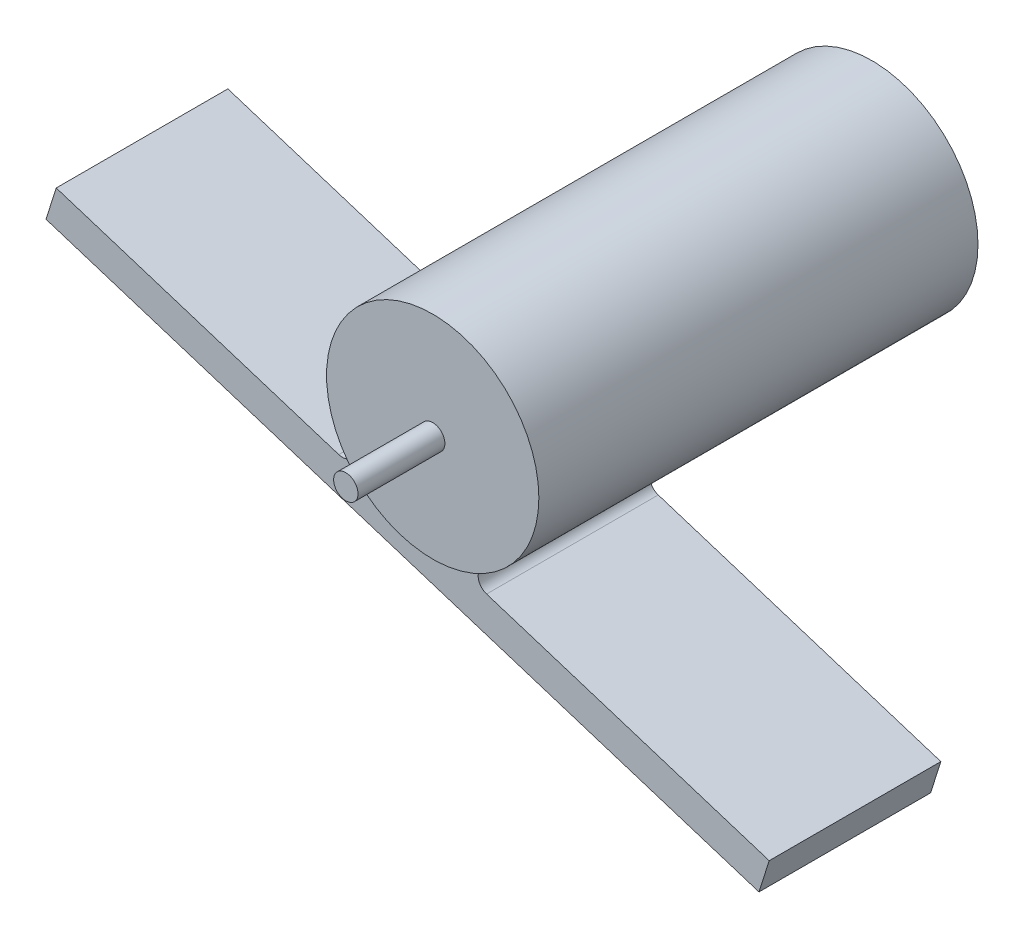
ISO-10303-21;
HEADER;
FILE_DESCRIPTION(('STEP AP214'),'2;1');
FILE_NAME('part.step','',(''),(''),'','','');
FILE_SCHEMA(('AUTOMOTIVE_DESIGN { 1 0 10303 214 1 1 1 1 }'));
ENDSEC;
DATA;
#1=APPLICATION_CONTEXT('core data for automotive mechanical design processes');
#2=APPLICATION_PROTOCOL_DEFINITION('international standard','automotive_design',2000,#1);
#3=PRODUCT_CONTEXT('',#1,'mechanical');
#4=PRODUCT('Part','Part','',(#3));
#5=PRODUCT_RELATED_PRODUCT_CATEGORY('part','',(#4));
#6=PRODUCT_DEFINITION_FORMATION('','',#4);
#7=PRODUCT_DEFINITION_CONTEXT('part definition',#1,'design');
#8=PRODUCT_DEFINITION('design','',#6,#7);
#9=PRODUCT_DEFINITION_SHAPE('','',#8);
#10=(LENGTH_UNIT() NAMED_UNIT(*) SI_UNIT(.MILLI.,.METRE.));
#11=(NAMED_UNIT(*) PLANE_ANGLE_UNIT() SI_UNIT($,.RADIAN.));
#12=(NAMED_UNIT(*) SI_UNIT($,.STERADIAN.) SOLID_ANGLE_UNIT());
#13=UNCERTAINTY_MEASURE_WITH_UNIT(LENGTH_MEASURE(1.E-05),#10,'distance_accuracy_value','');
#14=(GEOMETRIC_REPRESENTATION_CONTEXT(3) GLOBAL_UNCERTAINTY_ASSIGNED_CONTEXT((#13)) GLOBAL_UNIT_ASSIGNED_CONTEXT((#10,
#11,#12)) REPRESENTATION_CONTEXT('',''));
#15=CARTESIAN_POINT('',(0.,0.,0.));
#16=DIRECTION('',(0.,0.,1.));
#17=DIRECTION('',(1.,0.,0.));
#18=AXIS2_PLACEMENT_3D('',#15,#16,#17);
#19=CARTESIAN_POINT('',(-26.395929091397,-17.6179775965829,91.));
#20=DIRECTION('',(0.,0.,-1.));
#21=DIRECTION('',(-1.,0.,0.));
#22=AXIS2_PLACEMENT_3D('',#19,#20,#21);
#23=CYLINDRICAL_SURFACE('',#22,2.5);
#24=DIRECTION('',(0.,0.,-1.));
#25=VECTOR('',#24,1.);
#26=CARTESIAN_POINT('',(-24.2629499956505,-16.3139836636566,91.));
#27=LINE('',#26,#25);
#28=CARTESIAN_POINT('',(-24.2629499956505,-16.3139836636566,53.2267759557352));
#29=VERTEX_POINT('',#28);
#30=CARTESIAN_POINT('',(-24.2629499956505,-16.3139836636566,88.796688292896));
#31=VERTEX_POINT('',#30);
#32=EDGE_CURVE('E168',#29,#31,#27,.F.);
#33=ORIENTED_EDGE('',*,*,#32,.F.);
#34=CARTESIAN_POINT('',(-26.395929091397,-17.6179775965829,53.2267759557352));
#35=DIRECTION('',(0.,0.,1.));
#36=DIRECTION('',(1.,0.,0.));
#37=AXIS2_PLACEMENT_3D('',#34,#35,#36);
#38=CIRCLE('',#37,2.5);
#39=CARTESIAN_POINT('',(-27.1516380417584,-20.0010227036557,53.2267759557352));
#40=VERTEX_POINT('',#39);
#41=EDGE_CURVE('E41',#29,#40,#38,.F.);
#42=ORIENTED_EDGE('',*,*,#41,.T.);
#43=DIRECTION('',(0.,0.,1.));
#44=VECTOR('',#43,1.);
#45=CARTESIAN_POINT('',(-27.1516380417584,-20.0010227036557,91.));
#46=LINE('',#45,#44);
#47=CARTESIAN_POINT('',(-27.1516380417584,-20.0010227036557,88.796688292896));
#48=VERTEX_POINT('',#47);
#49=EDGE_CURVE('E171',#48,#40,#46,.F.);
#50=ORIENTED_EDGE('',*,*,#49,.F.);
#51=CARTESIAN_POINT('',(-26.395929091397,-17.6179775965829,88.796688292896));
#52=DIRECTION('',(0.,0.,-1.));
#53=DIRECTION('',(-1.,0.,0.));
#54=AXIS2_PLACEMENT_3D('',#51,#52,#53);
#55=CIRCLE('',#54,2.5);
#56=EDGE_CURVE('E11',#48,#31,#55,.F.);
#57=ORIENTED_EDGE('',*,*,#56,.T.);
#58=EDGE_LOOP('',(#33,#42,#50,#57));
#59=FACE_BOUND('',#58,.T.);
#60=ADVANCED_FACE('F34',(#59),#23,.F.);
#61=CARTESIAN_POINT('',(4.22596871988467,-27.3287640959051,91.));
#62=DIRECTION('',(0.,0.,-1.));
#63=DIRECTION('',(-1.,0.,0.));
#64=AXIS2_PLACEMENT_3D('',#61,#62,#63);
#65=CYLINDRICAL_SURFACE('',#64,2.5);
#66=DIRECTION('',(0.,0.,-1.));
#67=VECTOR('',#66,1.);
#68=CARTESIAN_POINT('',(3.23426436550035,-25.0338735814153,91.));
#69=LINE('',#68,#67);
#70=CARTESIAN_POINT('',(3.23426436550035,-25.0338735814153,88.796688292896));
#71=VERTEX_POINT('',#70);
#72=CARTESIAN_POINT('',(3.23426436550035,-25.0338735814153,53.2267759557352));
#73=VERTEX_POINT('',#72);
#74=EDGE_CURVE('E159',#71,#73,#69,.T.);
#75=ORIENTED_EDGE('',*,*,#74,.F.);
#76=CARTESIAN_POINT('',(4.22596871988467,-27.3287640959051,88.796688292896));
#77=DIRECTION('',(0.,0.,-1.));
#78=DIRECTION('',(-1.,0.,0.));
#79=AXIS2_PLACEMENT_3D('',#76,#77,#78);
#80=CIRCLE('',#79,2.5);
#81=CARTESIAN_POINT('',(3.47025976952327,-29.7118092029779,88.796688292896));
#82=VERTEX_POINT('',#81);
#83=EDGE_CURVE('E163',#71,#82,#80,.F.);
#84=ORIENTED_EDGE('',*,*,#83,.T.);
#85=DIRECTION('',(0.,0.,1.));
#86=VECTOR('',#85,1.);
#87=CARTESIAN_POINT('',(3.47025976952325,-29.7118092029779,91.));
#88=LINE('',#87,#86);
#89=CARTESIAN_POINT('',(3.47025976952329,-29.7118092029779,53.2267759557352));
#90=VERTEX_POINT('',#89);
#91=EDGE_CURVE('E116',#90,#82,#88,.T.);
#92=ORIENTED_EDGE('',*,*,#91,.F.);
#93=CARTESIAN_POINT('',(4.22596871988467,-27.3287640959051,53.2267759557352));
#94=DIRECTION('',(0.,0.,1.));
#95=DIRECTION('',(1.,0.,0.));
#96=AXIS2_PLACEMENT_3D('',#93,#94,#95);
#97=CIRCLE('',#96,2.5);
#98=EDGE_CURVE('E165',#90,#73,#97,.F.);
#99=ORIENTED_EDGE('',*,*,#98,.T.);
#100=EDGE_LOOP('',(#75,#84,#92,#99));
#101=FACE_BOUND('',#100,.T.);
#102=ADVANCED_FACE('F188',(#101),#65,.F.);
#103=CARTESIAN_POINT('',(-5.49273395308164,-4.83883705390524,91.));
#104=DIRECTION('',(0.,0.,-1.));
#105=DIRECTION('',(-1.,0.,0.));
#106=AXIS2_PLACEMENT_3D('',#103,#104,#105);
#107=CYLINDRICAL_SURFACE('',#106,22.);
#108=CARTESIAN_POINT('',(-5.49273395308164,-4.83883705390524,0.));
#109=DIRECTION('',(0.,0.,1.));
#110=DIRECTION('',(1.,0.,0.));
#111=AXIS2_PLACEMENT_3D('',#108,#109,#110);
#112=CIRCLE('',#111,22.);
#113=CARTESIAN_POINT('',(16.5072660469184,-4.83883705390524,0.));
#114=VERTEX_POINT('',#113);
#115=EDGE_CURVE('E147',#114,#114,#112,.T.);
#116=ORIENTED_EDGE('',*,*,#115,.T.);
#117=EDGE_LOOP('',(#116));
#118=FACE_BOUND('',#117,.T.);
#119=CARTESIAN_POINT('',(-5.49273395308164,-4.83883705390524,91.));
#120=DIRECTION('',(0.,0.,1.));
#121=DIRECTION('',(1.,0.,0.));
#122=AXIS2_PLACEMENT_3D('',#119,#120,#121);
#123=CIRCLE('',#122,22.);
#124=CARTESIAN_POINT('',(16.5072660469184,-4.83883705390524,91.));
#125=VERTEX_POINT('',#124);
#126=EDGE_CURVE('E150',#125,#125,#123,.T.);
#127=ORIENTED_EDGE('',*,*,#126,.F.);
#128=EDGE_LOOP('',(#127));
#129=FACE_BOUND('',#128,.T.);
#130=CARTESIAN_POINT('',(-5.49273395308164,-4.83883705390524,53.2267759557352));
#131=DIRECTION('',(0.,0.,1.));
#132=DIRECTION('',(1.,0.,0.));
#133=AXIS2_PLACEMENT_3D('',#130,#131,#132);
#134=CIRCLE('',#133,22.);
#135=EDGE_CURVE('E153',#29,#73,#134,.T.);
#136=ORIENTED_EDGE('',*,*,#135,.F.);
#137=ORIENTED_EDGE('',*,*,#32,.T.);
#138=CARTESIAN_POINT('',(-5.49273395308164,-4.83883705390524,88.796688292896));
#139=DIRECTION('',(0.,0.,-1.));
#140=DIRECTION('',(-1.,0.,0.));
#141=AXIS2_PLACEMENT_3D('',#138,#139,#140);
#142=CIRCLE('',#141,22.);
#143=EDGE_CURVE('E157',#71,#31,#142,.T.);
#144=ORIENTED_EDGE('',*,*,#143,.F.);
#145=ORIENTED_EDGE('',*,*,#74,.T.);
#146=EDGE_LOOP('',(#136,#137,#144,#145));
#147=FACE_BOUND('',#146,.T.);
#148=ADVANCED_FACE('F190',(#118,#129,#147),#107,.T.);
#149=CARTESIAN_POINT('',(-5.49273395308164,-4.83883705390524,91.));
#150=DIRECTION('',(0.,0.,1.));
#151=DIRECTION('',(1.,0.,0.));
#152=AXIS2_PLACEMENT_3D('',#149,#150,#151);
#153=PLANE('',#152);
#154=CARTESIAN_POINT('',(-5.49273395308164,-4.83883705390524,91.));
#155=DIRECTION('',(0.,0.,1.));
#156=DIRECTION('',(1.,0.,0.));
#157=AXIS2_PLACEMENT_3D('',#154,#155,#156);
#158=CIRCLE('',#157,2.52505257402676);
#159=CARTESIAN_POINT('',(-2.96768137905488,-4.83883705390524,91.));
#160=VERTEX_POINT('',#159);
#161=EDGE_CURVE('E106',#160,#160,#158,.T.);
#162=ORIENTED_EDGE('',*,*,#161,.F.);
#163=EDGE_LOOP('',(#162));
#164=FACE_BOUND('',#163,.T.);
#165=ORIENTED_EDGE('',*,*,#126,.T.);
#166=EDGE_LOOP('',(#165));
#167=FACE_BOUND('',#166,.T.);
#168=ADVANCED_FACE('F192',(#164,#167),#153,.T.);
#169=CARTESIAN_POINT('',(-5.49273395308164,-4.83883705390524,0.));
#170=DIRECTION('',(0.,0.,1.));
#171=DIRECTION('',(1.,0.,0.));
#172=AXIS2_PLACEMENT_3D('',#169,#170,#171);
#173=PLANE('',#172);
#174=ORIENTED_EDGE('',*,*,#115,.F.);
#175=EDGE_LOOP('',(#174));
#176=FACE_BOUND('',#175,.T.);
#177=ADVANCED_FACE('F200',(#176),#173,.F.);
#178=CARTESIAN_POINT('',(-5.49273395308164,-4.83883705390524,109.));
#179=DIRECTION('',(0.,0.,-1.));
#180=DIRECTION('',(-1.,0.,0.));
#181=AXIS2_PLACEMENT_3D('',#178,#179,#180);
#182=CYLINDRICAL_SURFACE('',#181,2.52505257402676);
#183=CARTESIAN_POINT('',(-5.49273395308164,-4.83883705390524,109.));
#184=DIRECTION('',(0.,0.,1.));
#185=DIRECTION('',(1.,0.,0.));
#186=AXIS2_PLACEMENT_3D('',#183,#184,#185);
#187=CIRCLE('',#186,2.52505257402676);
#188=CARTESIAN_POINT('',(-2.96768137905488,-4.83883705390524,109.));
#189=VERTEX_POINT('',#188);
#190=EDGE_CURVE('E144',#189,#189,#187,.T.);
#191=ORIENTED_EDGE('',*,*,#190,.F.);
#192=EDGE_LOOP('',(#191));
#193=FACE_BOUND('',#192,.T.);
#194=ORIENTED_EDGE('',*,*,#161,.T.);
#195=EDGE_LOOP('',(#194));
#196=FACE_BOUND('',#195,.T.);
#197=ADVANCED_FACE('F271',(#193,#196),#182,.T.);
#198=CARTESIAN_POINT('',(-5.49273395308164,-4.83883705390524,109.));
#199=DIRECTION('',(0.,0.,1.));
#200=DIRECTION('',(1.,0.,0.));
#201=AXIS2_PLACEMENT_3D('',#198,#199,#200);
#202=PLANE('',#201);
#203=ORIENTED_EDGE('',*,*,#190,.T.);
#204=EDGE_LOOP('',(#203));
#205=FACE_BOUND('',#204,.T.);
#206=ADVANCED_FACE('F268',(#205),#202,.T.);
#207=CARTESIAN_POINT('',(-8.24412871429806,-25.9969537019385,0.));
#208=DIRECTION('',(-0.302283580144569,-0.953218042829122,0.));
#209=DIRECTION('',(0.953218042829122,-0.302283580144569,0.));
#210=AXIS2_PLACEMENT_3D('',#207,#208,#209);
#211=PLANE('',#210);
#212=DIRECTION('',(-0.953218042829122,0.302283580144569,0.));
#213=VECTOR('',#212,1.);
#214=CARTESIAN_POINT('',(62.0337091831394,-48.2833934145209,88.796688292896));
#215=LINE('',#214,#213);
#216=CARTESIAN_POINT('',(-85.7150874553746,-1.42943849211276,88.796688292896));
#217=VERTEX_POINT('',#216);
#218=EDGE_CURVE('E118',#48,#217,#215,.T.);
#219=ORIENTED_EDGE('',*,*,#218,.F.);
#220=ORIENTED_EDGE('',*,*,#49,.T.);
#221=DIRECTION('',(0.953218042829122,-0.302283580144569,0.));
#222=VECTOR('',#221,1.);
#223=CARTESIAN_POINT('',(62.0337091831394,-48.2833934145209,53.2267759557352));
#224=LINE('',#223,#222);
#225=CARTESIAN_POINT('',(-85.7150874553746,-1.42943849211276,53.2267759557352));
#226=VERTEX_POINT('',#225);
#227=EDGE_CURVE('E129',#226,#40,#224,.T.);
#228=ORIENTED_EDGE('',*,*,#227,.F.);
#229=DIRECTION('',(0.,0.,-1.));
#230=VECTOR('',#229,1.);
#231=CARTESIAN_POINT('',(-85.7150874553746,-1.42943849211276,53.2267759557352));
#232=LINE('',#231,#230);
#233=EDGE_CURVE('E117',#217,#226,#232,.T.);
#234=ORIENTED_EDGE('',*,*,#233,.F.);
#235=EDGE_LOOP('',(#219,#220,#228,#234));
#236=FACE_BOUND('',#235,.T.);
#237=ADVANCED_FACE('F175',(#236),#211,.F.);
#238=CARTESIAN_POINT('',(62.0337091831394,-48.2833934145209,53.2267759557352));
#239=VERTEX_POINT('',#238);
#240=EDGE_CURVE('E128',#90,#239,#224,.T.);
#241=ORIENTED_EDGE('',*,*,#240,.F.);
#242=ORIENTED_EDGE('',*,*,#91,.T.);
#243=CARTESIAN_POINT('',(62.0337091831394,-48.2833934145209,88.796688292896));
#244=VERTEX_POINT('',#243);
#245=EDGE_CURVE('E99',#244,#82,#215,.T.);
#246=ORIENTED_EDGE('',*,*,#245,.F.);
#247=DIRECTION('',(0.,0.,1.));
#248=VECTOR('',#247,1.);
#249=CARTESIAN_POINT('',(62.0337091831394,-48.2833934145209,53.2267759557352));
#250=LINE('',#249,#248);
#251=EDGE_CURVE('E114',#239,#244,#250,.T.);
#252=ORIENTED_EDGE('',*,*,#251,.F.);
#253=EDGE_LOOP('',(#241,#242,#246,#252));
#254=FACE_BOUND('',#253,.T.);
#255=ADVANCED_FACE('F113',(#254),#211,.F.);
#256=CARTESIAN_POINT('',(59.9177241221274,-54.9559197143247,53.2267759557352));
#257=DIRECTION('',(-0.953218042829122,0.302283580144569,0.));
#258=DIRECTION('',(-0.302283580144569,-0.953218042829122,0.));
#259=AXIS2_PLACEMENT_3D('',#256,#257,#258);
#260=PLANE('',#259);
#261=DIRECTION('',(0.302283580144569,0.953218042829122,0.));
#262=VECTOR('',#261,1.);
#263=CARTESIAN_POINT('',(59.9177241221274,-54.9559197143247,53.2267759557352));
#264=LINE('',#263,#262);
#265=CARTESIAN_POINT('',(59.9177241221274,-54.9559197143247,53.2267759557352));
#266=VERTEX_POINT('',#265);
#267=EDGE_CURVE('E123',#266,#239,#264,.T.);
#268=ORIENTED_EDGE('',*,*,#267,.T.);
#269=ORIENTED_EDGE('',*,*,#251,.T.);
#270=DIRECTION('',(0.302283580144569,0.953218042829122,0.));
#271=VECTOR('',#270,1.);
#272=CARTESIAN_POINT('',(59.9177241221274,-54.9559197143247,88.796688292896));
#273=LINE('',#272,#271);
#274=CARTESIAN_POINT('',(59.9177241221274,-54.9559197143247,88.796688292896));
#275=VERTEX_POINT('',#274);
#276=EDGE_CURVE('E95',#275,#244,#273,.T.);
#277=ORIENTED_EDGE('',*,*,#276,.F.);
#278=DIRECTION('',(0.,0.,1.));
#279=VECTOR('',#278,1.);
#280=CARTESIAN_POINT('',(59.9177241221274,-54.9559197143247,53.2267759557352));
#281=LINE('',#280,#279);
#282=EDGE_CURVE('E132',#266,#275,#281,.T.);
#283=ORIENTED_EDGE('',*,*,#282,.F.);
#284=EDGE_LOOP('',(#268,#269,#277,#283));
#285=FACE_BOUND('',#284,.T.);
#286=ADVANCED_FACE('F121',(#285),#260,.F.);
#287=CARTESIAN_POINT('',(59.9177241221274,-54.9559197143247,88.796688292896));
#288=DIRECTION('',(0.,0.,-1.));
#289=DIRECTION('',(-1.,0.,0.));
#290=AXIS2_PLACEMENT_3D('',#287,#288,#289);
#291=PLANE('',#290);
#292=ORIENTED_EDGE('',*,*,#245,.T.);
#293=ORIENTED_EDGE('',*,*,#83,.F.);
#294=ORIENTED_EDGE('',*,*,#143,.T.);
#295=ORIENTED_EDGE('',*,*,#56,.F.);
#296=ORIENTED_EDGE('',*,*,#218,.T.);
#297=DIRECTION('',(0.302283580144569,0.953218042829122,0.));
#298=VECTOR('',#297,1.);
#299=CARTESIAN_POINT('',(-87.8310725163865,-8.1019647919166,88.796688292896));
#300=LINE('',#299,#298);
#301=CARTESIAN_POINT('',(-87.8310725163865,-8.1019647919166,88.796688292896));
#302=VERTEX_POINT('',#301);
#303=EDGE_CURVE('E107',#302,#217,#300,.T.);
#304=ORIENTED_EDGE('',*,*,#303,.F.);
#305=DIRECTION('',(-0.953218042829122,0.302283580144569,0.));
#306=VECTOR('',#305,1.);
#307=CARTESIAN_POINT('',(59.9177241221274,-54.9559197143247,88.796688292896));
#308=LINE('',#307,#306);
#309=EDGE_CURVE('E101',#275,#302,#308,.T.);
#310=ORIENTED_EDGE('',*,*,#309,.F.);
#311=ORIENTED_EDGE('',*,*,#276,.T.);
#312=EDGE_LOOP('',(#292,#293,#294,#295,#296,#304,#310,#311));
#313=FACE_BOUND('',#312,.T.);
#314=ADVANCED_FACE('F97',(#313),#291,.F.);
#315=CARTESIAN_POINT('',(-87.8310725163865,-8.1019647919166,53.2267759557352));
#316=DIRECTION('',(0.953218042829122,-0.302283580144569,0.));
#317=DIRECTION('',(0.302283580144569,0.953218042829122,0.));
#318=AXIS2_PLACEMENT_3D('',#315,#316,#317);
#319=PLANE('',#318);
#320=ORIENTED_EDGE('',*,*,#303,.T.);
#321=ORIENTED_EDGE('',*,*,#233,.T.);
#322=DIRECTION('',(0.302283580144569,0.953218042829122,0.));
#323=VECTOR('',#322,1.);
#324=CARTESIAN_POINT('',(-87.8310725163865,-8.1019647919166,53.2267759557352));
#325=LINE('',#324,#323);
#326=CARTESIAN_POINT('',(-87.8310725163865,-8.1019647919166,53.2267759557352));
#327=VERTEX_POINT('',#326);
#328=EDGE_CURVE('E140',#327,#226,#325,.T.);
#329=ORIENTED_EDGE('',*,*,#328,.F.);
#330=DIRECTION('',(0.,0.,-1.));
#331=VECTOR('',#330,1.);
#332=CARTESIAN_POINT('',(-87.8310725163865,-8.1019647919166,53.2267759557352));
#333=LINE('',#332,#331);
#334=EDGE_CURVE('E135',#302,#327,#333,.T.);
#335=ORIENTED_EDGE('',*,*,#334,.F.);
#336=EDGE_LOOP('',(#320,#321,#329,#335));
#337=FACE_BOUND('',#336,.T.);
#338=ADVANCED_FACE('F183',(#337),#319,.F.);
#339=CARTESIAN_POINT('',(59.9177241221274,-54.9559197143247,53.2267759557352));
#340=DIRECTION('',(0.,0.,1.));
#341=DIRECTION('',(1.,0.,0.));
#342=AXIS2_PLACEMENT_3D('',#339,#340,#341);
#343=PLANE('',#342);
#344=ORIENTED_EDGE('',*,*,#227,.T.);
#345=ORIENTED_EDGE('',*,*,#41,.F.);
#346=ORIENTED_EDGE('',*,*,#135,.T.);
#347=ORIENTED_EDGE('',*,*,#98,.F.);
#348=ORIENTED_EDGE('',*,*,#240,.T.);
#349=ORIENTED_EDGE('',*,*,#267,.F.);
#350=DIRECTION('',(0.953218042829122,-0.302283580144569,0.));
#351=VECTOR('',#350,1.);
#352=CARTESIAN_POINT('',(59.9177241221274,-54.9559197143247,53.2267759557352));
#353=LINE('',#352,#351);
#354=EDGE_CURVE('E137',#327,#266,#353,.T.);
#355=ORIENTED_EDGE('',*,*,#354,.F.);
#356=ORIENTED_EDGE('',*,*,#328,.T.);
#357=EDGE_LOOP('',(#344,#345,#346,#347,#348,#349,#355,#356));
#358=FACE_BOUND('',#357,.T.);
#359=ADVANCED_FACE('F178',(#358),#343,.F.);
#360=CARTESIAN_POINT('',(-10.36011377531,-32.6694800017423,0.));
#361=DIRECTION('',(-0.302283580144569,-0.953218042829122,0.));
#362=DIRECTION('',(0.953218042829122,-0.302283580144569,0.));
#363=AXIS2_PLACEMENT_3D('',#360,#361,#362);
#364=PLANE('',#363);
#365=ORIENTED_EDGE('',*,*,#282,.T.);
#366=ORIENTED_EDGE('',*,*,#309,.T.);
#367=ORIENTED_EDGE('',*,*,#334,.T.);
#368=ORIENTED_EDGE('',*,*,#354,.T.);
#369=EDGE_LOOP('',(#365,#366,#367,#368));
#370=FACE_BOUND('',#369,.T.);
#371=ADVANCED_FACE('F185',(#370),#364,.T.);
#372=CLOSED_SHELL('',(#60,#102,#148,#168,#177,#197,#206,#237,#255,#286,#314,#338,#359,#371));
#373=MANIFOLD_SOLID_BREP('B2',#372);
#374=ADVANCED_BREP_SHAPE_REPRESENTATION('',(#18,#373),#14);
#375=SHAPE_DEFINITION_REPRESENTATION(#9,#374);
ENDSEC;
END-ISO-10303-21;
